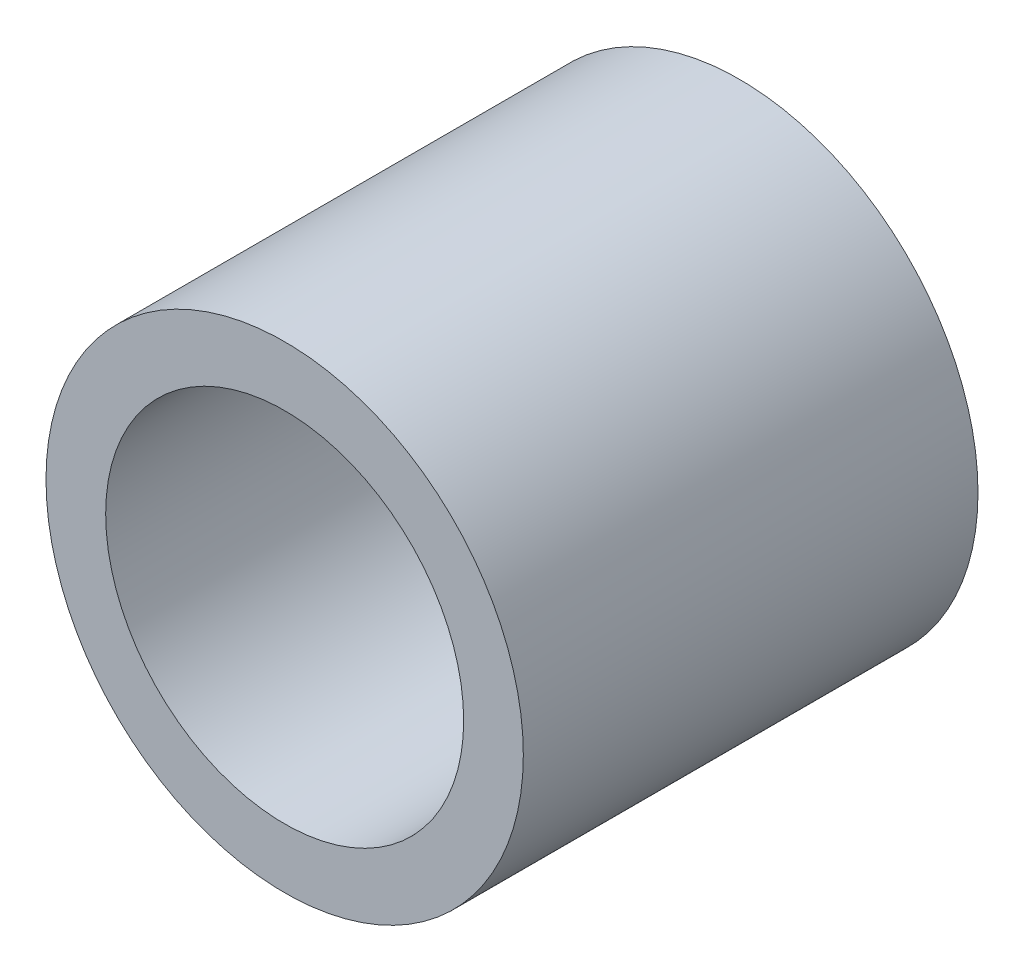
ISO-10303-21;
HEADER;
FILE_DESCRIPTION(('STEP AP214'),'2;1');
FILE_NAME('part.step','',(''),(''),'','','');
FILE_SCHEMA(('AUTOMOTIVE_DESIGN { 1 0 10303 214 1 1 1 1 }'));
ENDSEC;
DATA;
#1=APPLICATION_CONTEXT('core data for automotive mechanical design processes');
#2=APPLICATION_PROTOCOL_DEFINITION('international standard','automotive_design',2000,#1);
#3=PRODUCT_CONTEXT('',#1,'mechanical');
#4=PRODUCT('Part','Part','',(#3));
#5=PRODUCT_RELATED_PRODUCT_CATEGORY('part','',(#4));
#6=PRODUCT_DEFINITION_FORMATION('','',#4);
#7=PRODUCT_DEFINITION_CONTEXT('part definition',#1,'design');
#8=PRODUCT_DEFINITION('design','',#6,#7);
#9=PRODUCT_DEFINITION_SHAPE('','',#8);
#10=(LENGTH_UNIT() NAMED_UNIT(*) SI_UNIT(.MILLI.,.METRE.));
#11=(NAMED_UNIT(*) PLANE_ANGLE_UNIT() SI_UNIT($,.RADIAN.));
#12=(NAMED_UNIT(*) SI_UNIT($,.STERADIAN.) SOLID_ANGLE_UNIT());
#13=UNCERTAINTY_MEASURE_WITH_UNIT(LENGTH_MEASURE(1.E-05),#10,'distance_accuracy_value','');
#14=(GEOMETRIC_REPRESENTATION_CONTEXT(3) GLOBAL_UNCERTAINTY_ASSIGNED_CONTEXT((#13)) GLOBAL_UNIT_ASSIGNED_CONTEXT((#10,
#11,#12)) REPRESENTATION_CONTEXT('',''));
#15=CARTESIAN_POINT('',(0.,0.,0.));
#16=DIRECTION('',(0.,0.,1.));
#17=DIRECTION('',(1.,0.,0.));
#18=AXIS2_PLACEMENT_3D('',#15,#16,#17);
#19=CARTESIAN_POINT('',(0.,0.,3.81));
#20=DIRECTION('',(0.,0.,1.));
#21=DIRECTION('',(1.,0.,0.));
#22=AXIS2_PLACEMENT_3D('',#19,#20,#21);
#23=PLANE('',#22);
#24=CARTESIAN_POINT('',(0.,0.,3.81));
#25=DIRECTION('',(0.,0.,1.));
#26=DIRECTION('',(1.,0.,0.));
#27=AXIS2_PLACEMENT_3D('',#24,#25,#26);
#28=CIRCLE('',#27,2.);
#29=CARTESIAN_POINT('',(2.,0.,3.81));
#30=VERTEX_POINT('',#29);
#31=EDGE_CURVE('E10',#30,#30,#28,.T.);
#32=ORIENTED_EDGE('',*,*,#31,.T.);
#33=EDGE_LOOP('',(#32));
#34=FACE_BOUND('',#33,.T.);
#35=CARTESIAN_POINT('',(0.,0.,3.81));
#36=DIRECTION('',(0.,0.,1.));
#37=DIRECTION('',(1.,0.,0.));
#38=AXIS2_PLACEMENT_3D('',#35,#36,#37);
#39=CIRCLE('',#38,1.5);
#40=CARTESIAN_POINT('',(1.5,0.,3.81));
#41=VERTEX_POINT('',#40);
#42=EDGE_CURVE('E43',#41,#41,#39,.T.);
#43=ORIENTED_EDGE('',*,*,#42,.F.);
#44=EDGE_LOOP('',(#43));
#45=FACE_BOUND('',#44,.T.);
#46=ADVANCED_FACE('F32',(#34,#45),#23,.T.);
#47=CARTESIAN_POINT('',(0.,0.,0.));
#48=DIRECTION('',(0.,0.,1.));
#49=DIRECTION('',(1.,0.,0.));
#50=AXIS2_PLACEMENT_3D('',#47,#48,#49);
#51=PLANE('',#50);
#52=CARTESIAN_POINT('',(0.,0.,0.));
#53=DIRECTION('',(0.,0.,1.));
#54=DIRECTION('',(1.,0.,0.));
#55=AXIS2_PLACEMENT_3D('',#52,#53,#54);
#56=CIRCLE('',#55,2.);
#57=CARTESIAN_POINT('',(2.,0.,0.));
#58=VERTEX_POINT('',#57);
#59=EDGE_CURVE('E36',#58,#58,#56,.T.);
#60=ORIENTED_EDGE('',*,*,#59,.F.);
#61=EDGE_LOOP('',(#60));
#62=FACE_BOUND('',#61,.T.);
#63=CARTESIAN_POINT('',(0.,0.,0.));
#64=DIRECTION('',(0.,0.,1.));
#65=DIRECTION('',(1.,0.,0.));
#66=AXIS2_PLACEMENT_3D('',#63,#64,#65);
#67=CIRCLE('',#66,1.5);
#68=CARTESIAN_POINT('',(1.5,0.,0.));
#69=VERTEX_POINT('',#68);
#70=EDGE_CURVE('E45',#69,#69,#67,.T.);
#71=ORIENTED_EDGE('',*,*,#70,.T.);
#72=EDGE_LOOP('',(#71));
#73=FACE_BOUND('',#72,.T.);
#74=ADVANCED_FACE('F55',(#62,#73),#51,.F.);
#75=CARTESIAN_POINT('',(0.,0.,3.81));
#76=DIRECTION('',(0.,0.,-1.));
#77=DIRECTION('',(-1.,0.,0.));
#78=AXIS2_PLACEMENT_3D('',#75,#76,#77);
#79=CYLINDRICAL_SURFACE('',#78,2.);
#80=ORIENTED_EDGE('',*,*,#31,.F.);
#81=EDGE_LOOP('',(#80));
#82=FACE_BOUND('',#81,.T.);
#83=ORIENTED_EDGE('',*,*,#59,.T.);
#84=EDGE_LOOP('',(#83));
#85=FACE_BOUND('',#84,.T.);
#86=ADVANCED_FACE('F34',(#82,#85),#79,.T.);
#87=CARTESIAN_POINT('',(0.,0.,3.81));
#88=DIRECTION('',(0.,0.,-1.));
#89=DIRECTION('',(-1.,0.,0.));
#90=AXIS2_PLACEMENT_3D('',#87,#88,#89);
#91=CYLINDRICAL_SURFACE('',#90,1.5);
#92=ORIENTED_EDGE('',*,*,#42,.T.);
#93=EDGE_LOOP('',(#92));
#94=FACE_BOUND('',#93,.T.);
#95=ORIENTED_EDGE('',*,*,#70,.F.);
#96=EDGE_LOOP('',(#95));
#97=FACE_BOUND('',#96,.T.);
#98=ADVANCED_FACE('F51',(#94,#97),#91,.F.);
#99=CLOSED_SHELL('',(#46,#74,#86,#98));
#100=MANIFOLD_SOLID_BREP('B2',#99);
#101=ADVANCED_BREP_SHAPE_REPRESENTATION('',(#18,#100),#14);
#102=SHAPE_DEFINITION_REPRESENTATION(#9,#101);
ENDSEC;
END-ISO-10303-21;
